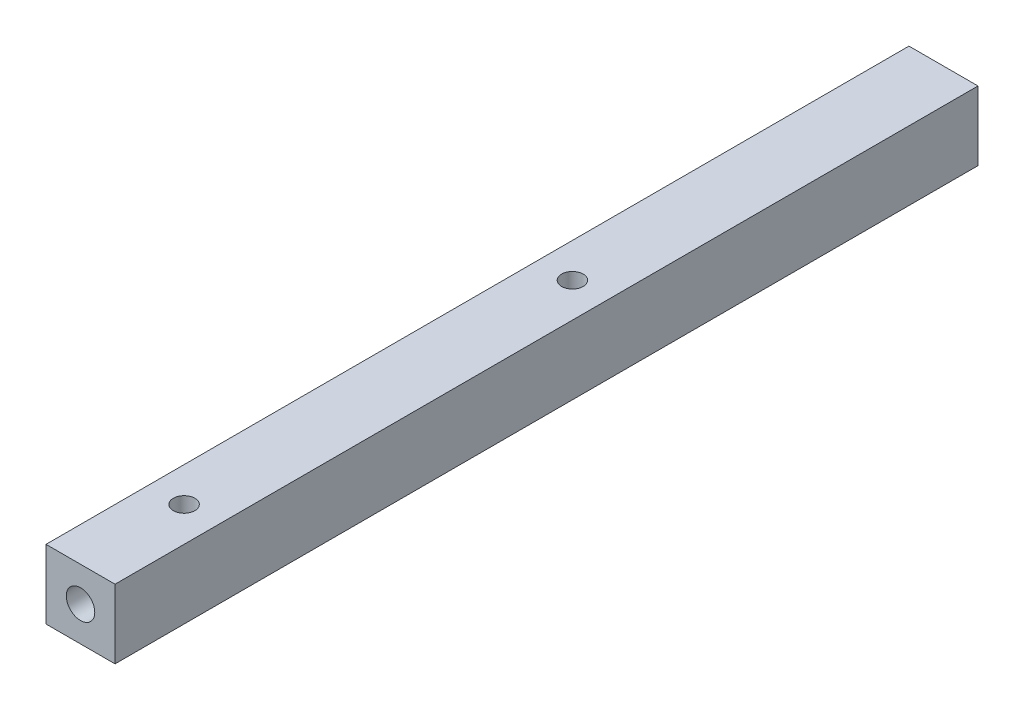
ISO-10303-21;
HEADER;
FILE_DESCRIPTION(('STEP AP214'),'2;1');
FILE_NAME('part.step','',(''),(''),'','','');
FILE_SCHEMA(('AUTOMOTIVE_DESIGN { 1 0 10303 214 1 1 1 1 }'));
ENDSEC;
DATA;
#1=APPLICATION_CONTEXT('core data for automotive mechanical design processes');
#2=APPLICATION_PROTOCOL_DEFINITION('international standard','automotive_design',2000,#1);
#3=PRODUCT_CONTEXT('',#1,'mechanical');
#4=PRODUCT('Part','Part','',(#3));
#5=PRODUCT_RELATED_PRODUCT_CATEGORY('part','',(#4));
#6=PRODUCT_DEFINITION_FORMATION('','',#4);
#7=PRODUCT_DEFINITION_CONTEXT('part definition',#1,'design');
#8=PRODUCT_DEFINITION('design','',#6,#7);
#9=PRODUCT_DEFINITION_SHAPE('','',#8);
#10=(LENGTH_UNIT() NAMED_UNIT(*) SI_UNIT(.MILLI.,.METRE.));
#11=(NAMED_UNIT(*) PLANE_ANGLE_UNIT() SI_UNIT($,.RADIAN.));
#12=(NAMED_UNIT(*) SI_UNIT($,.STERADIAN.) SOLID_ANGLE_UNIT());
#13=UNCERTAINTY_MEASURE_WITH_UNIT(LENGTH_MEASURE(1.E-05),#10,'distance_accuracy_value','');
#14=(GEOMETRIC_REPRESENTATION_CONTEXT(3) GLOBAL_UNCERTAINTY_ASSIGNED_CONTEXT((#13)) GLOBAL_UNIT_ASSIGNED_CONTEXT((#10,
#11,#12)) REPRESENTATION_CONTEXT('',''));
#15=CARTESIAN_POINT('',(0.,0.,0.));
#16=DIRECTION('',(0.,0.,1.));
#17=DIRECTION('',(1.,0.,0.));
#18=AXIS2_PLACEMENT_3D('',#15,#16,#17);
#19=CARTESIAN_POINT('',(0.,0.,100.));
#20=DIRECTION('',(1.,0.,0.));
#21=DIRECTION('',(0.,0.,-1.));
#22=AXIS2_PLACEMENT_3D('',#19,#20,#21);
#23=PLANE('',#22);
#24=DIRECTION('',(0.,-1.,0.));
#25=VECTOR('',#24,1.);
#26=CARTESIAN_POINT('',(0.,0.,0.));
#27=LINE('',#26,#25);
#28=CARTESIAN_POINT('',(0.,8.,0.));
#29=VERTEX_POINT('',#28);
#30=CARTESIAN_POINT('',(0.,0.,0.));
#31=VERTEX_POINT('',#30);
#32=EDGE_CURVE('E110',#29,#31,#27,.T.);
#33=ORIENTED_EDGE('',*,*,#32,.T.);
#34=DIRECTION('',(0.,0.,-1.));
#35=VECTOR('',#34,1.);
#36=CARTESIAN_POINT('',(0.,0.,100.));
#37=LINE('',#36,#35);
#38=CARTESIAN_POINT('',(0.,0.,100.));
#39=VERTEX_POINT('',#38);
#40=EDGE_CURVE('E11',#39,#31,#37,.T.);
#41=ORIENTED_EDGE('',*,*,#40,.F.);
#42=DIRECTION('',(0.,-1.,0.));
#43=VECTOR('',#42,1.);
#44=CARTESIAN_POINT('',(0.,0.,100.));
#45=LINE('',#44,#43);
#46=CARTESIAN_POINT('',(0.,8.,100.));
#47=VERTEX_POINT('',#46);
#48=EDGE_CURVE('E119',#47,#39,#45,.T.);
#49=ORIENTED_EDGE('',*,*,#48,.F.);
#50=DIRECTION('',(0.,0.,-1.));
#51=VECTOR('',#50,1.);
#52=CARTESIAN_POINT('',(0.,8.,100.));
#53=LINE('',#52,#51);
#54=EDGE_CURVE('E125',#47,#29,#53,.T.);
#55=ORIENTED_EDGE('',*,*,#54,.T.);
#56=EDGE_LOOP('',(#33,#41,#49,#55));
#57=FACE_BOUND('',#56,.T.);
#58=ADVANCED_FACE('F33',(#57),#23,.F.);
#59=CARTESIAN_POINT('',(0.,0.,100.));
#60=DIRECTION('',(0.,1.,0.));
#61=DIRECTION('',(0.,0.,1.));
#62=AXIS2_PLACEMENT_3D('',#59,#60,#61);
#63=PLANE('',#62);
#64=CARTESIAN_POINT('',(4.,0.,88.));
#65=DIRECTION('',(0.,1.,0.));
#66=DIRECTION('',(0.,0.,1.));
#67=AXIS2_PLACEMENT_3D('',#64,#65,#66);
#68=CIRCLE('',#67,1.25);
#69=CARTESIAN_POINT('',(4.,0.,89.25));
#70=VERTEX_POINT('',#69);
#71=EDGE_CURVE('E92',#70,#70,#68,.T.);
#72=ORIENTED_EDGE('',*,*,#71,.T.);
#73=EDGE_LOOP('',(#72));
#74=FACE_BOUND('',#73,.T.);
#75=CARTESIAN_POINT('',(4.,0.,43.));
#76=DIRECTION('',(0.,1.,0.));
#77=DIRECTION('',(0.,0.,1.));
#78=AXIS2_PLACEMENT_3D('',#75,#76,#77);
#79=CIRCLE('',#78,1.25);
#80=CARTESIAN_POINT('',(4.,0.,44.25));
#81=VERTEX_POINT('',#80);
#82=EDGE_CURVE('E104',#81,#81,#79,.T.);
#83=ORIENTED_EDGE('',*,*,#82,.T.);
#84=EDGE_LOOP('',(#83));
#85=FACE_BOUND('',#84,.T.);
#86=DIRECTION('',(1.,0.,0.));
#87=VECTOR('',#86,1.);
#88=CARTESIAN_POINT('',(0.,0.,0.));
#89=LINE('',#88,#87);
#90=CARTESIAN_POINT('',(8.,0.,0.));
#91=VERTEX_POINT('',#90);
#92=EDGE_CURVE('E113',#31,#91,#89,.T.);
#93=ORIENTED_EDGE('',*,*,#92,.T.);
#94=DIRECTION('',(0.,0.,-1.));
#95=VECTOR('',#94,1.);
#96=CARTESIAN_POINT('',(8.,0.,100.));
#97=LINE('',#96,#95);
#98=CARTESIAN_POINT('',(8.,0.,100.));
#99=VERTEX_POINT('',#98);
#100=EDGE_CURVE('E45',#99,#91,#97,.T.);
#101=ORIENTED_EDGE('',*,*,#100,.F.);
#102=DIRECTION('',(1.,0.,0.));
#103=VECTOR('',#102,1.);
#104=CARTESIAN_POINT('',(0.,0.,100.));
#105=LINE('',#104,#103);
#106=EDGE_CURVE('E121',#39,#99,#105,.T.);
#107=ORIENTED_EDGE('',*,*,#106,.F.);
#108=ORIENTED_EDGE('',*,*,#40,.T.);
#109=EDGE_LOOP('',(#93,#101,#107,#108));
#110=FACE_BOUND('',#109,.T.);
#111=ADVANCED_FACE('F147',(#74,#85,#110),#63,.F.);
#112=CARTESIAN_POINT('',(8.,0.,100.));
#113=DIRECTION('',(-1.,0.,0.));
#114=DIRECTION('',(0.,0.,1.));
#115=AXIS2_PLACEMENT_3D('',#112,#113,#114);
#116=PLANE('',#115);
#117=DIRECTION('',(0.,1.,0.));
#118=VECTOR('',#117,1.);
#119=CARTESIAN_POINT('',(8.,0.,0.));
#120=LINE('',#119,#118);
#121=CARTESIAN_POINT('',(8.,8.,0.));
#122=VERTEX_POINT('',#121);
#123=EDGE_CURVE('E115',#91,#122,#120,.T.);
#124=ORIENTED_EDGE('',*,*,#123,.T.);
#125=DIRECTION('',(0.,0.,-1.));
#126=VECTOR('',#125,1.);
#127=CARTESIAN_POINT('',(8.,8.,100.));
#128=LINE('',#127,#126);
#129=CARTESIAN_POINT('',(8.,8.,100.));
#130=VERTEX_POINT('',#129);
#131=EDGE_CURVE('E128',#130,#122,#128,.T.);
#132=ORIENTED_EDGE('',*,*,#131,.F.);
#133=DIRECTION('',(0.,1.,0.));
#134=VECTOR('',#133,1.);
#135=CARTESIAN_POINT('',(8.,0.,100.));
#136=LINE('',#135,#134);
#137=EDGE_CURVE('E57',#99,#130,#136,.T.);
#138=ORIENTED_EDGE('',*,*,#137,.F.);
#139=ORIENTED_EDGE('',*,*,#100,.T.);
#140=EDGE_LOOP('',(#124,#132,#138,#139));
#141=FACE_BOUND('',#140,.T.);
#142=ADVANCED_FACE('F135',(#141),#116,.F.);
#143=CARTESIAN_POINT('',(0.,8.,100.));
#144=DIRECTION('',(0.,-1.,0.));
#145=DIRECTION('',(0.,0.,-1.));
#146=AXIS2_PLACEMENT_3D('',#143,#144,#145);
#147=PLANE('',#146);
#148=CARTESIAN_POINT('',(4.,8.,88.));
#149=DIRECTION('',(0.,1.,0.));
#150=DIRECTION('',(0.,0.,1.));
#151=AXIS2_PLACEMENT_3D('',#148,#149,#150);
#152=CIRCLE('',#151,1.24999999999999);
#153=CARTESIAN_POINT('',(4.,8.,89.25));
#154=VERTEX_POINT('',#153);
#155=EDGE_CURVE('E101',#154,#154,#152,.T.);
#156=ORIENTED_EDGE('',*,*,#155,.F.);
#157=EDGE_LOOP('',(#156));
#158=FACE_BOUND('',#157,.T.);
#159=CARTESIAN_POINT('',(4.,8.,43.));
#160=DIRECTION('',(0.,1.,0.));
#161=DIRECTION('',(0.,0.,1.));
#162=AXIS2_PLACEMENT_3D('',#159,#160,#161);
#163=CIRCLE('',#162,1.24999999999999);
#164=CARTESIAN_POINT('',(4.,8.,44.25));
#165=VERTEX_POINT('',#164);
#166=EDGE_CURVE('E107',#165,#165,#163,.T.);
#167=ORIENTED_EDGE('',*,*,#166,.F.);
#168=EDGE_LOOP('',(#167));
#169=FACE_BOUND('',#168,.T.);
#170=DIRECTION('',(-1.,0.,0.));
#171=VECTOR('',#170,1.);
#172=CARTESIAN_POINT('',(0.,8.,0.));
#173=LINE('',#172,#171);
#174=EDGE_CURVE('E117',#122,#29,#173,.T.);
#175=ORIENTED_EDGE('',*,*,#174,.T.);
#176=ORIENTED_EDGE('',*,*,#54,.F.);
#177=DIRECTION('',(-1.,0.,0.));
#178=VECTOR('',#177,1.);
#179=CARTESIAN_POINT('',(0.,8.,100.));
#180=LINE('',#179,#178);
#181=EDGE_CURVE('E52',#130,#47,#180,.T.);
#182=ORIENTED_EDGE('',*,*,#181,.F.);
#183=ORIENTED_EDGE('',*,*,#131,.T.);
#184=EDGE_LOOP('',(#175,#176,#182,#183));
#185=FACE_BOUND('',#184,.T.);
#186=ADVANCED_FACE('F142',(#158,#169,#185),#147,.F.);
#187=CARTESIAN_POINT('',(0.,8.,100.));
#188=DIRECTION('',(0.,0.,-1.));
#189=DIRECTION('',(-1.,0.,0.));
#190=AXIS2_PLACEMENT_3D('',#187,#188,#189);
#191=PLANE('',#190);
#192=CARTESIAN_POINT('',(4.,4.,100.));
#193=DIRECTION('',(0.,0.,1.));
#194=DIRECTION('',(1.,0.,0.));
#195=AXIS2_PLACEMENT_3D('',#192,#193,#194);
#196=CIRCLE('',#195,1.64999999999999);
#197=CARTESIAN_POINT('',(5.64999999999999,4.,100.));
#198=VERTEX_POINT('',#197);
#199=EDGE_CURVE('E95',#198,#198,#196,.T.);
#200=ORIENTED_EDGE('',*,*,#199,.F.);
#201=EDGE_LOOP('',(#200));
#202=FACE_BOUND('',#201,.T.);
#203=ORIENTED_EDGE('',*,*,#48,.T.);
#204=ORIENTED_EDGE('',*,*,#106,.T.);
#205=ORIENTED_EDGE('',*,*,#137,.T.);
#206=ORIENTED_EDGE('',*,*,#181,.T.);
#207=EDGE_LOOP('',(#203,#204,#205,#206));
#208=FACE_BOUND('',#207,.T.);
#209=ADVANCED_FACE('F146',(#202,#208),#191,.F.);
#210=CARTESIAN_POINT('',(0.,8.,0.));
#211=DIRECTION('',(0.,0.,-1.));
#212=DIRECTION('',(-1.,0.,0.));
#213=AXIS2_PLACEMENT_3D('',#210,#211,#212);
#214=PLANE('',#213);
#215=CARTESIAN_POINT('',(4.,4.,0.));
#216=DIRECTION('',(0.,0.,-1.));
#217=DIRECTION('',(-1.,0.,0.));
#218=AXIS2_PLACEMENT_3D('',#215,#216,#217);
#219=CIRCLE('',#218,1.64999999999999);
#220=CARTESIAN_POINT('',(2.35000000000001,4.,0.));
#221=VERTEX_POINT('',#220);
#222=EDGE_CURVE('E89',#221,#221,#219,.T.);
#223=ORIENTED_EDGE('',*,*,#222,.F.);
#224=EDGE_LOOP('',(#223));
#225=FACE_BOUND('',#224,.T.);
#226=ORIENTED_EDGE('',*,*,#32,.F.);
#227=ORIENTED_EDGE('',*,*,#174,.F.);
#228=ORIENTED_EDGE('',*,*,#123,.F.);
#229=ORIENTED_EDGE('',*,*,#92,.F.);
#230=EDGE_LOOP('',(#226,#227,#228,#229));
#231=FACE_BOUND('',#230,.T.);
#232=ADVANCED_FACE('F140',(#225,#231),#214,.T.);
#233=CARTESIAN_POINT('',(4.,8.,43.));
#234=DIRECTION('',(0.,1.,0.));
#235=DIRECTION('',(0.,0.,1.));
#236=AXIS2_PLACEMENT_3D('',#233,#234,#235);
#237=CYLINDRICAL_SURFACE('',#236,1.24999999999999);
#238=ORIENTED_EDGE('',*,*,#82,.F.);
#239=EDGE_LOOP('',(#238));
#240=FACE_BOUND('',#239,.T.);
#241=ORIENTED_EDGE('',*,*,#166,.T.);
#242=EDGE_LOOP('',(#241));
#243=FACE_BOUND('',#242,.T.);
#244=ADVANCED_FACE('F165',(#240,#243),#237,.F.);
#245=CARTESIAN_POINT('',(4.,8.,88.));
#246=DIRECTION('',(0.,1.,0.));
#247=DIRECTION('',(0.,0.,1.));
#248=AXIS2_PLACEMENT_3D('',#245,#246,#247);
#249=CYLINDRICAL_SURFACE('',#248,1.24999999999999);
#250=CARTESIAN_POINT('',(3.69460003407508,3.85344338680325,89.212118336598));
#251=CARTESIAN_POINT('',(3.7022552138986,3.83007139695723,89.2140474901291));
#252=CARTESIAN_POINT('',(3.71179187255399,3.8073344282127,89.2163770205164));
#253=CARTESIAN_POINT('',(3.73458261452655,3.76384447085555,89.2215521809429));
#254=CARTESIAN_POINT('',(3.74783726990966,3.74309178821258,89.2243978903797));
#255=CARTESIAN_POINT('',(3.77476814047062,3.70856616381955,89.2295999435874));
#256=CARTESIAN_POINT('',(3.78775154250674,3.69424857926091,89.2319312161521));
#257=CARTESIAN_POINT('',(3.81589117526684,3.6679138558386,89.2364490031618));
#258=CARTESIAN_POINT('',(3.83104401655318,3.65589319550928,89.2386357357821));
#259=CARTESIAN_POINT('',(3.86050963913836,3.63661943370758,89.2422650983469));
#260=CARTESIAN_POINT('',(3.87450904545929,3.62890061238345,89.2437709936124));
#261=CARTESIAN_POINT('',(3.90362233459026,3.61585080637075,89.246364407575));
#262=CARTESIAN_POINT('',(3.91873555449418,3.61051841451115,89.2474521727712));
#263=CARTESIAN_POINT('',(3.94978945789176,3.60256601062579,89.2490882996316));
#264=CARTESIAN_POINT('',(3.96573434104725,3.59996152309727,89.2496335731061));
#265=CARTESIAN_POINT('',(3.99783986398524,3.59772582772766,89.25010104517));
#266=CARTESIAN_POINT('',(4.01400042511151,3.59809356400495,89.2500234650282));
#267=CARTESIAN_POINT('',(4.04443511696806,3.60159080210085,89.2492939331478));
#268=CARTESIAN_POINT('',(4.05874233358529,3.60445395955602,89.2486973837283));
#269=CARTESIAN_POINT('',(4.08669527154432,3.61240196074864,89.2470686115327));
#270=CARTESIAN_POINT('',(4.10034087697622,3.61748719222744,89.2460363127215));
#271=CARTESIAN_POINT('',(4.12726540344905,3.62987352429032,89.2435812753212));
#272=CARTESIAN_POINT('',(4.14050280259988,3.63726110703765,89.2421435543899));
#273=CARTESIAN_POINT('',(4.16576645804263,3.65382800784297,89.2390253516435));
#274=CARTESIAN_POINT('',(4.17779218061758,3.66300811028125,89.2373447636373));
#275=CARTESIAN_POINT('',(4.20244803612355,3.68452478762049,89.2335702886971));
#276=CARTESIAN_POINT('',(4.21483756560299,3.69713260193896,89.2314545214657));
#277=CARTESIAN_POINT('',(4.23774476966947,3.72394616997703,89.2272380640481));
#278=CARTESIAN_POINT('',(4.24826116818872,3.73815300235431,89.2251373850688));
#279=CARTESIAN_POINT('',(4.26933542912458,3.77083751600844,89.2206953660431));
#280=CARTESIAN_POINT('',(4.27946660802331,3.78959611579369,89.2183919893305));
#281=CARTESIAN_POINT('',(4.29693415377899,3.82842032066613,89.2142531064211));
#282=CARTESIAN_POINT('',(4.30426884791219,3.84848669962899,89.2124178804662));
#283=CARTESIAN_POINT('',(4.31697319842884,3.89249081750773,89.2091641065351));
#284=CARTESIAN_POINT('',(4.32189841837233,3.91656546036516,89.207845790316));
#285=CARTESIAN_POINT('',(4.32798002429244,3.96521803375838,89.2062084780344));
#286=CARTESIAN_POINT('',(4.32913569781859,3.98979605855099,89.2058896708811));
#287=CARTESIAN_POINT('',(4.32762696165832,4.04009114750997,89.2063007961151));
#288=CARTESIAN_POINT('',(4.32476393843575,4.06580210216278,89.2070852585328));
#289=CARTESIAN_POINT('',(4.31488529187085,4.11637964818937,89.2096995605545));
#290=CARTESIAN_POINT('',(4.30786678982621,4.14124564157847,89.2115301248135));
#291=CARTESIAN_POINT('',(4.28975420616715,4.1893191303419,89.2159890091311));
#292=CARTESIAN_POINT('',(4.27866832734882,4.21252985219926,89.218615721733));
#293=CARTESIAN_POINT('',(4.25247540504034,4.25650194046186,89.2243100523558));
#294=CARTESIAN_POINT('',(4.23737393141387,4.27726664250696,89.2273770569753));
#295=CARTESIAN_POINT('',(4.20804839606203,4.30996605085013,89.2326276026995));
#296=CARTESIAN_POINT('',(4.19476320491519,4.32274498526353,89.2348179954508));
#297=CARTESIAN_POINT('',(4.16627124366776,4.34598674318936,89.2389754739417));
#298=CARTESIAN_POINT('',(4.15106735904254,4.35645298100569,89.2409428867531));
#299=CARTESIAN_POINT('',(4.12152168029586,4.37306459378642,89.2441530473615));
#300=CARTESIAN_POINT('',(4.10742498634876,4.37963183571937,89.2454612232518));
#301=CARTESIAN_POINT('',(4.07830835901215,4.3903666404381,89.2476298551448));
#302=CARTESIAN_POINT('',(4.06328895458061,4.39453556414845,89.2484905650352));
#303=CARTESIAN_POINT('',(4.03265960740533,4.40020884611307,89.2496675314709));
#304=CARTESIAN_POINT('',(4.01704738498437,4.40170156373927,89.2499814093079));
#305=CARTESIAN_POINT('',(3.98580737683494,4.40187142921855,89.250016960765));
#306=CARTESIAN_POINT('',(3.97017959313538,4.40054890563679,89.2497387034927));
#307=CARTESIAN_POINT('',(3.94054113594095,4.3953875253529,89.2486668600067));
#308=CARTESIAN_POINT('',(3.9264952937509,4.39173775412813,89.2479120361352));
#309=CARTESIAN_POINT('',(3.89916508970316,4.38232362532136,89.2460016949758));
#310=CARTESIAN_POINT('',(3.88588089589497,4.37655880313642,89.2448460896532));
#311=CARTESIAN_POINT('',(3.85940465196176,4.36272116842063,89.2421443418128));
#312=CARTESIAN_POINT('',(3.84628562344761,4.35451391601217,89.2405763523702));
#313=CARTESIAN_POINT('',(3.8213576698919,4.33634796578709,89.2372329663329));
#314=CARTESIAN_POINT('',(3.80954940453136,4.32638839252171,89.2354574662168));
#315=CARTESIAN_POINT('',(3.78531382754567,4.303096626427,89.2314978279668));
#316=CARTESIAN_POINT('',(3.77316251908946,4.28948035242708,89.2292979704634));
#317=CARTESIAN_POINT('',(3.75087076068586,4.26068341989399,89.2249749730837));
#318=CARTESIAN_POINT('',(3.74073162570982,4.24550174814263,89.2228518841125));
#319=CARTESIAN_POINT('',(3.72067050731753,4.21077442186359,89.218442027615));
#320=CARTESIAN_POINT('',(3.7111962176698,4.19096271804123,89.2162072390907));
#321=CARTESIAN_POINT('',(3.69521978294188,4.15011770750186,89.2123021876991));
#322=CARTESIAN_POINT('',(3.68871985654228,4.12908350201625,89.2106323464869));
#323=CARTESIAN_POINT('',(3.67808364836567,4.08347273364455,89.2078512308798));
#324=CARTESIAN_POINT('',(3.67436551818949,4.05879163259046,89.2068410425036));
#325=CARTESIAN_POINT('',(3.6708248796011,4.00914837010468,89.2058803231511));
#326=CARTESIAN_POINT('',(3.67099931553789,3.98418644450455,89.2059289609993));
#327=CARTESIAN_POINT('',(3.67465146862778,3.94139536000079,89.2069175271976));
#328=CARTESIAN_POINT('',(3.67721553399355,3.92347715812772,89.2076108174136));
#329=CARTESIAN_POINT('',(3.68438180737943,3.88807310136393,89.2095035874052));
#330=CARTESIAN_POINT('',(3.68898474291156,3.87058740315324,89.2107032478572));
#331=CARTESIAN_POINT('',(3.69460003407508,3.85344338680325,89.212118336598));
#332=B_SPLINE_CURVE_WITH_KNOTS('',3,(#250,#251,#252,#253,#254,#255,#256,#257,#258,#259,#260,
#261,#262,#263,#264,#265,#266,#267,#268,#269,#270,#271,#272,#273,#274,#275,#276,#277,#278,#279,
#280,#281,#282,#283,#284,#285,#286,#287,#288,#289,#290,#291,#292,#293,#294,#295,#296,#297,#298,
#299,#300,#301,#302,#303,#304,#305,#306,#307,#308,#309,#310,#311,#312,#313,#314,#315,#316,#317,
#318,#319,#320,#321,#322,#323,#324,#325,#326,#327,#328,#329,#330,#331),.UNSPECIFIED.,.T.,.F.,(4,
2,2,2,2,2,2,2,2,2,2,2,2,2,2,2,2,2,2,2,2,2,2,2,2,2,2,2,2,2,2,2,2,2,2,2,2,2,2,2,4),(0.,
0.0739457685033511,0.147902920847256,0.206086852624347,0.264180852743816,0.312156307730917,
0.360103436338448,0.408321973378772,0.456523381551171,0.500134458618003,0.543753148651362,
0.589262230181422,0.634791270626333,0.688005266760574,0.741255377341893,0.805337031270352,
0.869456955875277,0.942957031176921,1.01647099730902,1.09374879911901,1.17108019776135,
1.24825648957812,1.32532628678842,1.38081053856149,1.43621232170287,1.48283592243373,
1.52943304046092,1.57623235357229,1.62302620506266,1.66643268962443,1.70984871479155,
1.75633659069412,1.80284775794614,1.85779269796854,1.91277342755399,1.97873353805782,
2.04474277060868,2.11934995352274,2.19389857211682,2.24812052400668,2.30236183904175),.UNSPECIFIED.);
#333=CARTESIAN_POINT('',(3.69460003407508,3.85344338680325,89.212118336598));
#334=VERTEX_POINT('',#333);
#335=EDGE_CURVE('E36',#334,#334,#332,.T.);
#336=ORIENTED_EDGE('',*,*,#335,.T.);
#337=EDGE_LOOP('',(#336));
#338=FACE_BOUND('',#337,.T.);
#339=ORIENTED_EDGE('',*,*,#71,.F.);
#340=EDGE_LOOP('',(#339));
#341=FACE_BOUND('',#340,.T.);
#342=ORIENTED_EDGE('',*,*,#155,.T.);
#343=EDGE_LOOP('',(#342));
#344=FACE_BOUND('',#343,.T.);
#345=ADVANCED_FACE('F168',(#338,#341,#344),#249,.F.);
#346=CARTESIAN_POINT('',(4.,4.,0.));
#347=DIRECTION('',(0.,0.,-1.));
#348=DIRECTION('',(-1.,0.,0.));
#349=AXIS2_PLACEMENT_3D('',#346,#347,#348);
#350=CYLINDRICAL_SURFACE('',#349,1.64999999999999);
#351=CARTESIAN_POINT('',(4.,4.,10.));
#352=DIRECTION('',(0.,0.,-1.));
#353=DIRECTION('',(-1.,0.,0.));
#354=AXIS2_PLACEMENT_3D('',#351,#352,#353);
#355=CIRCLE('',#354,1.65);
#356=CARTESIAN_POINT('',(2.35,4.,10.));
#357=VERTEX_POINT('',#356);
#358=EDGE_CURVE('E87',#357,#357,#355,.T.);
#359=ORIENTED_EDGE('',*,*,#358,.F.);
#360=EDGE_LOOP('',(#359));
#361=FACE_BOUND('',#360,.T.);
#362=ORIENTED_EDGE('',*,*,#222,.T.);
#363=EDGE_LOOP('',(#362));
#364=FACE_BOUND('',#363,.T.);
#365=ADVANCED_FACE('F83',(#361,#364),#350,.F.);
#366=CARTESIAN_POINT('',(4.,4.,10.));
#367=DIRECTION('',(0.,0.,-1.));
#368=DIRECTION('',(-1.,0.,0.));
#369=AXIS2_PLACEMENT_3D('',#366,#367,#368);
#370=CONICAL_SURFACE('',#369,1.65,1.02974425867665);
#371=CARTESIAN_POINT('',(4.,4.,10.9914200213955));
#372=VERTEX_POINT('',#371);
#373=VERTEX_LOOP('',#372);
#374=FACE_BOUND('',#373,.T.);
#375=ORIENTED_EDGE('',*,*,#358,.T.);
#376=EDGE_LOOP('',(#375));
#377=FACE_BOUND('',#376,.T.);
#378=ADVANCED_FACE('F79',(#374,#377),#370,.F.);
#379=CARTESIAN_POINT('',(4.,4.,90.));
#380=DIRECTION('',(0.,0.,1.));
#381=DIRECTION('',(1.,0.,0.));
#382=AXIS2_PLACEMENT_3D('',#379,#380,#381);
#383=CONICAL_SURFACE('',#382,1.65,1.02974425867665);
#384=CARTESIAN_POINT('',(4.,4.,90.));
#385=DIRECTION('',(0.,0.,1.));
#386=DIRECTION('',(1.,0.,0.));
#387=AXIS2_PLACEMENT_3D('',#384,#385,#386);
#388=CIRCLE('',#387,1.65);
#389=CARTESIAN_POINT('',(5.65,4.,90.));
#390=VERTEX_POINT('',#389);
#391=EDGE_CURVE('E187',#390,#390,#388,.T.);
#392=ORIENTED_EDGE('',*,*,#391,.T.);
#393=EDGE_LOOP('',(#392));
#394=FACE_BOUND('',#393,.T.);
#395=ORIENTED_EDGE('',*,*,#335,.F.);
#396=EDGE_LOOP('',(#395));
#397=FACE_BOUND('',#396,.T.);
#398=ADVANCED_FACE('F82',(#394,#397),#383,.F.);
#399=CARTESIAN_POINT('',(4.,4.,100.));
#400=DIRECTION('',(0.,0.,1.));
#401=DIRECTION('',(1.,0.,0.));
#402=AXIS2_PLACEMENT_3D('',#399,#400,#401);
#403=CYLINDRICAL_SURFACE('',#402,1.64999999999999);
#404=ORIENTED_EDGE('',*,*,#391,.F.);
#405=EDGE_LOOP('',(#404));
#406=FACE_BOUND('',#405,.T.);
#407=ORIENTED_EDGE('',*,*,#199,.T.);
#408=EDGE_LOOP('',(#407));
#409=FACE_BOUND('',#408,.T.);
#410=ADVANCED_FACE('F176',(#406,#409),#403,.F.);
#411=CLOSED_SHELL('',(#58,#111,#142,#186,#209,#232,#244,#345,#365,#378,#398,#410));
#412=MANIFOLD_SOLID_BREP('B2',#411);
#413=ADVANCED_BREP_SHAPE_REPRESENTATION('',(#18,#412),#14);
#414=SHAPE_DEFINITION_REPRESENTATION(#9,#413);
ENDSEC;
END-ISO-10303-21;
